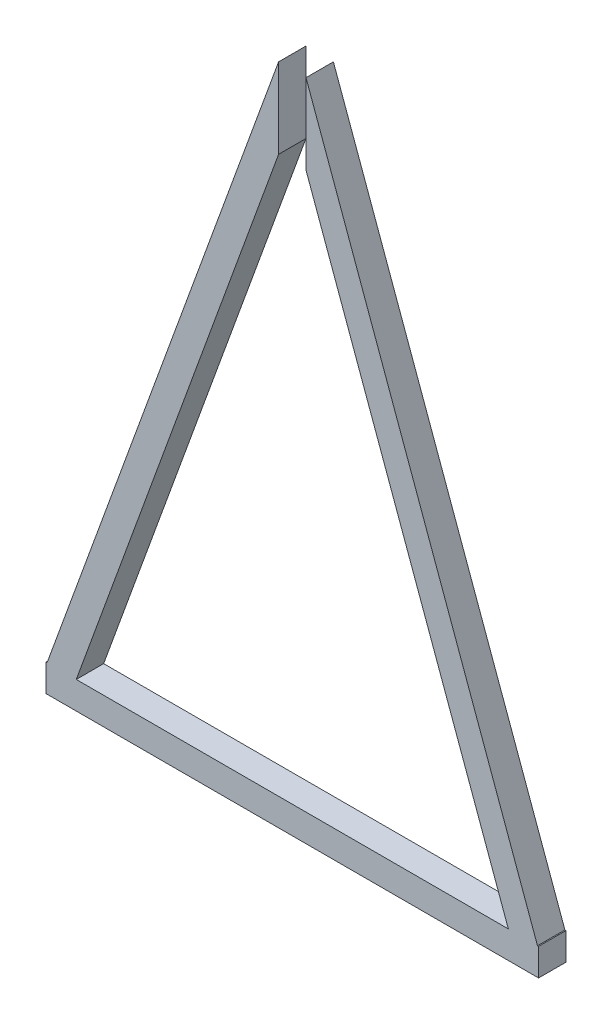
ISO-10303-21;
HEADER;
FILE_DESCRIPTION(('STEP AP214'),'2;1');
FILE_NAME('part.step','',(''),(''),'','','');
FILE_SCHEMA(('AUTOMOTIVE_DESIGN { 1 0 10303 214 1 1 1 1 }'));
ENDSEC;
DATA;
#1=APPLICATION_CONTEXT('core data for automotive mechanical design processes');
#2=APPLICATION_PROTOCOL_DEFINITION('international standard','automotive_design',2000,#1);
#3=PRODUCT_CONTEXT('',#1,'mechanical');
#4=PRODUCT('Part','Part','',(#3));
#5=PRODUCT_RELATED_PRODUCT_CATEGORY('part','',(#4));
#6=PRODUCT_DEFINITION_FORMATION('','',#4);
#7=PRODUCT_DEFINITION_CONTEXT('part definition',#1,'design');
#8=PRODUCT_DEFINITION('design','',#6,#7);
#9=PRODUCT_DEFINITION_SHAPE('','',#8);
#10=(LENGTH_UNIT() NAMED_UNIT(*) SI_UNIT(.MILLI.,.METRE.));
#11=(NAMED_UNIT(*) PLANE_ANGLE_UNIT() SI_UNIT($,.RADIAN.));
#12=(NAMED_UNIT(*) SI_UNIT($,.STERADIAN.) SOLID_ANGLE_UNIT());
#13=UNCERTAINTY_MEASURE_WITH_UNIT(LENGTH_MEASURE(1.E-05),#10,'distance_accuracy_value','');
#14=(GEOMETRIC_REPRESENTATION_CONTEXT(3) GLOBAL_UNCERTAINTY_ASSIGNED_CONTEXT((#13)) GLOBAL_UNIT_ASSIGNED_CONTEXT((#10,
#11,#12)) REPRESENTATION_CONTEXT('',''));
#15=CARTESIAN_POINT('',(0.,0.,0.));
#16=DIRECTION('',(0.,0.,1.));
#17=DIRECTION('',(1.,0.,0.));
#18=AXIS2_PLACEMENT_3D('',#15,#16,#17);
#19=CARTESIAN_POINT('',(0.,76.2,76.2));
#20=DIRECTION('',(0.,-1.,0.));
#21=DIRECTION('',(0.,0.,-1.));
#22=AXIS2_PLACEMENT_3D('',#19,#20,#21);
#23=PLANE('',#22);
#24=DIRECTION('',(-1.,0.,0.));
#25=VECTOR('',#24,1.);
#26=CARTESIAN_POINT('',(0.,76.2,76.2));
#27=LINE('',#26,#25);
#28=CARTESIAN_POINT('',(2.95543030107781,76.2,76.2));
#29=VERTEX_POINT('',#28);
#30=CARTESIAN_POINT('',(0.,76.2,76.2));
#31=VERTEX_POINT('',#30);
#32=EDGE_CURVE('E47',#29,#31,#27,.T.);
#33=ORIENTED_EDGE('',*,*,#32,.F.);
#34=DIRECTION('',(0.,0.,1.));
#35=VECTOR('',#34,1.);
#36=CARTESIAN_POINT('',(2.95543030107781,76.2,-1882.76796634687));
#37=LINE('',#36,#35);
#38=CARTESIAN_POINT('',(2.95543030107781,76.2,0.));
#39=VERTEX_POINT('',#38);
#40=EDGE_CURVE('E134',#39,#29,#37,.T.);
#41=ORIENTED_EDGE('',*,*,#40,.F.);
#42=DIRECTION('',(-1.,0.,0.));
#43=VECTOR('',#42,1.);
#44=CARTESIAN_POINT('',(0.,76.2,0.));
#45=LINE('',#44,#43);
#46=CARTESIAN_POINT('',(0.,76.2,0.));
#47=VERTEX_POINT('',#46);
#48=EDGE_CURVE('E122',#39,#47,#45,.T.);
#49=ORIENTED_EDGE('',*,*,#48,.T.);
#50=DIRECTION('',(0.,0.,-1.));
#51=VECTOR('',#50,1.);
#52=CARTESIAN_POINT('',(0.,76.2,76.2));
#53=LINE('',#52,#51);
#54=EDGE_CURVE('E196',#31,#47,#53,.T.);
#55=ORIENTED_EDGE('',*,*,#54,.F.);
#56=EDGE_LOOP('',(#33,#41,#49,#55));
#57=FACE_BOUND('',#56,.T.);
#58=ADVANCED_FACE('F32',(#57),#23,.F.);
#59=CARTESIAN_POINT('',(1285.95422343626,76.2000000000003,0.));
#60=VERTEX_POINT('',#59);
#61=CARTESIAN_POINT('',(84.0457765637421,76.2,0.));
#62=VERTEX_POINT('',#61);
#63=EDGE_CURVE('E130',#60,#62,#45,.T.);
#64=ORIENTED_EDGE('',*,*,#63,.T.);
#65=DIRECTION('',(0.,0.,1.));
#66=VECTOR('',#65,1.);
#67=CARTESIAN_POINT('',(84.0457765637421,76.2,-1882.76796634687));
#68=LINE('',#67,#66);
#69=CARTESIAN_POINT('',(84.0457765637421,76.2,76.2));
#70=VERTEX_POINT('',#69);
#71=EDGE_CURVE('E55',#62,#70,#68,.T.);
#72=ORIENTED_EDGE('',*,*,#71,.T.);
#73=CARTESIAN_POINT('',(1285.95422343626,76.2,76.2));
#74=VERTEX_POINT('',#73);
#75=EDGE_CURVE('E197',#74,#70,#27,.T.);
#76=ORIENTED_EDGE('',*,*,#75,.F.);
#77=DIRECTION('',(0.,0.,1.));
#78=VECTOR('',#77,1.);
#79=CARTESIAN_POINT('',(1285.95422343626,76.2,-1882.76796634687));
#80=LINE('',#79,#78);
#81=EDGE_CURVE('E175',#60,#74,#80,.T.);
#82=ORIENTED_EDGE('',*,*,#81,.F.);
#83=EDGE_LOOP('',(#64,#72,#76,#82));
#84=FACE_BOUND('',#83,.T.);
#85=ADVANCED_FACE('F226',(#84),#23,.F.);
#86=CARTESIAN_POINT('',(0.,0.,76.2));
#87=DIRECTION('',(1.,0.,0.));
#88=DIRECTION('',(0.,0.,-1.));
#89=AXIS2_PLACEMENT_3D('',#86,#87,#88);
#90=PLANE('',#89);
#91=DIRECTION('',(0.,-1.,0.));
#92=VECTOR('',#91,1.);
#93=CARTESIAN_POINT('',(0.,0.,0.));
#94=LINE('',#93,#92);
#95=CARTESIAN_POINT('',(0.,0.,0.));
#96=VERTEX_POINT('',#95);
#97=EDGE_CURVE('E128',#47,#96,#94,.T.);
#98=ORIENTED_EDGE('',*,*,#97,.T.);
#99=DIRECTION('',(0.,0.,-1.));
#100=VECTOR('',#99,1.);
#101=CARTESIAN_POINT('',(0.,0.,76.2));
#102=LINE('',#101,#100);
#103=CARTESIAN_POINT('',(0.,0.,76.2));
#104=VERTEX_POINT('',#103);
#105=EDGE_CURVE('E11',#104,#96,#102,.T.);
#106=ORIENTED_EDGE('',*,*,#105,.F.);
#107=DIRECTION('',(0.,-1.,0.));
#108=VECTOR('',#107,1.);
#109=CARTESIAN_POINT('',(0.,0.,76.2));
#110=LINE('',#109,#108);
#111=EDGE_CURVE('E186',#31,#104,#110,.T.);
#112=ORIENTED_EDGE('',*,*,#111,.F.);
#113=ORIENTED_EDGE('',*,*,#54,.T.);
#114=EDGE_LOOP('',(#98,#106,#112,#113));
#115=FACE_BOUND('',#114,.T.);
#116=ADVANCED_FACE('F34',(#115),#90,.F.);
#117=CARTESIAN_POINT('',(0.,0.,76.2));
#118=DIRECTION('',(0.,1.,0.));
#119=DIRECTION('',(0.,0.,1.));
#120=AXIS2_PLACEMENT_3D('',#117,#118,#119);
#121=PLANE('',#120);
#122=DIRECTION('',(1.,0.,0.));
#123=VECTOR('',#122,1.);
#124=CARTESIAN_POINT('',(0.,0.,0.));
#125=LINE('',#124,#123);
#126=CARTESIAN_POINT('',(1370.,0.,0.));
#127=VERTEX_POINT('',#126);
#128=EDGE_CURVE('E199',#96,#127,#125,.T.);
#129=ORIENTED_EDGE('',*,*,#128,.T.);
#130=DIRECTION('',(0.,0.,-1.));
#131=VECTOR('',#130,1.);
#132=CARTESIAN_POINT('',(1370.,0.,76.2));
#133=LINE('',#132,#131);
#134=CARTESIAN_POINT('',(1370.,0.,76.2));
#135=VERTEX_POINT('',#134);
#136=EDGE_CURVE('E40',#135,#127,#133,.T.);
#137=ORIENTED_EDGE('',*,*,#136,.F.);
#138=DIRECTION('',(1.,0.,0.));
#139=VECTOR('',#138,1.);
#140=CARTESIAN_POINT('',(0.,0.,76.2));
#141=LINE('',#140,#139);
#142=EDGE_CURVE('E189',#104,#135,#141,.T.);
#143=ORIENTED_EDGE('',*,*,#142,.F.);
#144=ORIENTED_EDGE('',*,*,#105,.T.);
#145=EDGE_LOOP('',(#129,#137,#143,#144));
#146=FACE_BOUND('',#145,.T.);
#147=ADVANCED_FACE('F223',(#146),#121,.F.);
#148=CARTESIAN_POINT('',(1370.,0.,76.2));
#149=DIRECTION('',(-1.,0.,0.));
#150=DIRECTION('',(0.,0.,1.));
#151=AXIS2_PLACEMENT_3D('',#148,#149,#150);
#152=PLANE('',#151);
#153=DIRECTION('',(0.,1.,0.));
#154=VECTOR('',#153,1.);
#155=CARTESIAN_POINT('',(1370.,0.,0.));
#156=LINE('',#155,#154);
#157=CARTESIAN_POINT('',(1370.,76.2,0.));
#158=VERTEX_POINT('',#157);
#159=EDGE_CURVE('E131',#127,#158,#156,.T.);
#160=ORIENTED_EDGE('',*,*,#159,.T.);
#161=DIRECTION('',(0.,0.,-1.));
#162=VECTOR('',#161,1.);
#163=CARTESIAN_POINT('',(1370.,76.2,76.2));
#164=LINE('',#163,#162);
#165=CARTESIAN_POINT('',(1370.,76.2,76.2));
#166=VERTEX_POINT('',#165);
#167=EDGE_CURVE('E204',#166,#158,#164,.T.);
#168=ORIENTED_EDGE('',*,*,#167,.F.);
#169=DIRECTION('',(0.,1.,0.));
#170=VECTOR('',#169,1.);
#171=CARTESIAN_POINT('',(1370.,0.,76.2));
#172=LINE('',#171,#170);
#173=EDGE_CURVE('E191',#135,#166,#172,.T.);
#174=ORIENTED_EDGE('',*,*,#173,.F.);
#175=ORIENTED_EDGE('',*,*,#136,.T.);
#176=EDGE_LOOP('',(#160,#168,#174,#175));
#177=FACE_BOUND('',#176,.T.);
#178=ADVANCED_FACE('F211',(#177),#152,.F.);
#179=CARTESIAN_POINT('',(1367.04456969892,76.2,0.));
#180=VERTEX_POINT('',#179);
#181=EDGE_CURVE('E133',#158,#180,#45,.T.);
#182=ORIENTED_EDGE('',*,*,#181,.T.);
#183=DIRECTION('',(0.,0.,1.));
#184=VECTOR('',#183,1.);
#185=CARTESIAN_POINT('',(1367.04456969892,76.2000000000002,-1882.76796634687));
#186=LINE('',#185,#184);
#187=CARTESIAN_POINT('',(1367.04456969892,76.2,76.2));
#188=VERTEX_POINT('',#187);
#189=EDGE_CURVE('E181',#180,#188,#186,.T.);
#190=ORIENTED_EDGE('',*,*,#189,.T.);
#191=EDGE_CURVE('E193',#166,#188,#27,.T.);
#192=ORIENTED_EDGE('',*,*,#191,.F.);
#193=ORIENTED_EDGE('',*,*,#167,.T.);
#194=EDGE_LOOP('',(#182,#190,#192,#193));
#195=FACE_BOUND('',#194,.T.);
#196=ADVANCED_FACE('F217',(#195),#23,.F.);
#197=CARTESIAN_POINT('',(0.,0.,76.2));
#198=DIRECTION('',(0.,0.,-1.));
#199=DIRECTION('',(-1.,0.,0.));
#200=AXIS2_PLACEMENT_3D('',#197,#198,#199);
#201=PLANE('',#200);
#202=ORIENTED_EDGE('',*,*,#111,.T.);
#203=ORIENTED_EDGE('',*,*,#142,.T.);
#204=ORIENTED_EDGE('',*,*,#173,.T.);
#205=ORIENTED_EDGE('',*,*,#191,.T.);
#206=DIRECTION('',(-0.342020143325663,0.939692620785911,0.));
#207=VECTOR('',#206,1.);
#208=CARTESIAN_POINT('',(723.1,1845.42316462825,76.2));
#209=LINE('',#208,#207);
#210=CARTESIAN_POINT('',(723.1,1845.42316462825,76.2));
#211=VERTEX_POINT('',#210);
#212=EDGE_CURVE('E160',#188,#211,#209,.T.);
#213=ORIENTED_EDGE('',*,*,#212,.T.);
#214=DIRECTION('',(0.,-1.,0.));
#215=VECTOR('',#214,1.);
#216=CARTESIAN_POINT('',(723.1,1845.42316462825,76.2));
#217=LINE('',#216,#215);
#218=CARTESIAN_POINT('',(723.1,1622.62926933581,76.2));
#219=VERTEX_POINT('',#218);
#220=EDGE_CURVE('E165',#211,#219,#217,.T.);
#221=ORIENTED_EDGE('',*,*,#220,.T.);
#222=DIRECTION('',(0.342020143325663,-0.93969262078591,0.));
#223=VECTOR('',#222,1.);
#224=CARTESIAN_POINT('',(723.1,1622.62926933581,76.2));
#225=LINE('',#224,#223);
#226=EDGE_CURVE('E161',#219,#74,#225,.T.);
#227=ORIENTED_EDGE('',*,*,#226,.T.);
#228=ORIENTED_EDGE('',*,*,#75,.T.);
#229=DIRECTION('',(0.342020143325663,0.939692620785911,0.));
#230=VECTOR('',#229,1.);
#231=CARTESIAN_POINT('',(646.9,1622.62926933581,76.2));
#232=LINE('',#231,#230);
#233=CARTESIAN_POINT('',(646.9,1622.62926933581,76.2));
#234=VERTEX_POINT('',#233);
#235=EDGE_CURVE('E142',#70,#234,#232,.T.);
#236=ORIENTED_EDGE('',*,*,#235,.T.);
#237=DIRECTION('',(0.,1.,0.));
#238=VECTOR('',#237,1.);
#239=CARTESIAN_POINT('',(646.9,1845.42316462825,76.2));
#240=LINE('',#239,#238);
#241=CARTESIAN_POINT('',(646.9,1845.42316462825,76.2));
#242=VERTEX_POINT('',#241);
#243=EDGE_CURVE('E149',#234,#242,#240,.T.);
#244=ORIENTED_EDGE('',*,*,#243,.T.);
#245=DIRECTION('',(-0.342020143325663,-0.93969262078591,0.));
#246=VECTOR('',#245,1.);
#247=CARTESIAN_POINT('',(646.9,1845.42316462825,76.2));
#248=LINE('',#247,#246);
#249=EDGE_CURVE('E145',#242,#29,#248,.T.);
#250=ORIENTED_EDGE('',*,*,#249,.T.);
#251=ORIENTED_EDGE('',*,*,#32,.T.);
#252=EDGE_LOOP('',(#202,#203,#204,#205,#213,#221,#227,#228,#236,#244,#250,#251));
#253=FACE_BOUND('',#252,.T.);
#254=ADVANCED_FACE('F220',(#253),#201,.F.);
#255=CARTESIAN_POINT('',(0.,0.,0.));
#256=DIRECTION('',(0.,0.,-1.));
#257=DIRECTION('',(-1.,0.,0.));
#258=AXIS2_PLACEMENT_3D('',#255,#256,#257);
#259=PLANE('',#258);
#260=ORIENTED_EDGE('',*,*,#97,.F.);
#261=ORIENTED_EDGE('',*,*,#48,.F.);
#262=DIRECTION('',(-0.342020143325663,-0.939692620785911,0.));
#263=VECTOR('',#262,1.);
#264=CARTESIAN_POINT('',(646.9,1845.42316462825,0.));
#265=LINE('',#264,#263);
#266=CARTESIAN_POINT('',(646.9,1845.42316462825,0.));
#267=VERTEX_POINT('',#266);
#268=EDGE_CURVE('E125',#267,#39,#265,.T.);
#269=ORIENTED_EDGE('',*,*,#268,.F.);
#270=DIRECTION('',(0.,1.,0.));
#271=VECTOR('',#270,1.);
#272=CARTESIAN_POINT('',(646.9,1845.42316462825,0.));
#273=LINE('',#272,#271);
#274=CARTESIAN_POINT('',(646.9,1622.62926933581,0.));
#275=VERTEX_POINT('',#274);
#276=EDGE_CURVE('E151',#275,#267,#273,.T.);
#277=ORIENTED_EDGE('',*,*,#276,.F.);
#278=DIRECTION('',(0.342020143325663,0.939692620785911,0.));
#279=VECTOR('',#278,1.);
#280=CARTESIAN_POINT('',(646.9,1622.62926933581,0.));
#281=LINE('',#280,#279);
#282=EDGE_CURVE('E154',#62,#275,#281,.T.);
#283=ORIENTED_EDGE('',*,*,#282,.F.);
#284=ORIENTED_EDGE('',*,*,#63,.F.);
#285=DIRECTION('',(0.342020143325663,-0.93969262078591,0.));
#286=VECTOR('',#285,1.);
#287=CARTESIAN_POINT('',(723.1,1622.62926933581,0.));
#288=LINE('',#287,#286);
#289=CARTESIAN_POINT('',(723.1,1622.62926933581,0.));
#290=VERTEX_POINT('',#289);
#291=EDGE_CURVE('E173',#290,#60,#288,.T.);
#292=ORIENTED_EDGE('',*,*,#291,.F.);
#293=DIRECTION('',(0.,-1.,0.));
#294=VECTOR('',#293,1.);
#295=CARTESIAN_POINT('',(723.1,1845.42316462825,0.));
#296=LINE('',#295,#294);
#297=CARTESIAN_POINT('',(723.1,1845.42316462825,0.));
#298=VERTEX_POINT('',#297);
#299=EDGE_CURVE('E177',#298,#290,#296,.T.);
#300=ORIENTED_EDGE('',*,*,#299,.F.);
#301=DIRECTION('',(-0.342020143325663,0.939692620785911,0.));
#302=VECTOR('',#301,1.);
#303=CARTESIAN_POINT('',(723.1,1845.42316462825,0.));
#304=LINE('',#303,#302);
#305=EDGE_CURVE('E164',#180,#298,#304,.T.);
#306=ORIENTED_EDGE('',*,*,#305,.F.);
#307=ORIENTED_EDGE('',*,*,#181,.F.);
#308=ORIENTED_EDGE('',*,*,#159,.F.);
#309=ORIENTED_EDGE('',*,*,#128,.F.);
#310=EDGE_LOOP('',(#260,#261,#269,#277,#283,#284,#292,#300,#306,#307,#308,#309));
#311=FACE_BOUND('',#310,.T.);
#312=ADVANCED_FACE('F123',(#311),#259,.T.);
#313=CARTESIAN_POINT('',(723.1,1845.42316462825,-1882.76796634687));
#314=DIRECTION('',(0.93969262078591,0.342020143325663,0.));
#315=DIRECTION('',(-0.342020143325663,0.939692620785911,0.));
#316=AXIS2_PLACEMENT_3D('',#313,#314,#315);
#317=PLANE('',#316);
#318=ORIENTED_EDGE('',*,*,#189,.F.);
#319=ORIENTED_EDGE('',*,*,#305,.T.);
#320=DIRECTION('',(0.,0.,1.));
#321=VECTOR('',#320,1.);
#322=CARTESIAN_POINT('',(723.1,1845.42316462825,-1882.76796634687));
#323=LINE('',#322,#321);
#324=EDGE_CURVE('E172',#298,#211,#323,.T.);
#325=ORIENTED_EDGE('',*,*,#324,.T.);
#326=ORIENTED_EDGE('',*,*,#212,.F.);
#327=EDGE_LOOP('',(#318,#319,#325,#326));
#328=FACE_BOUND('',#327,.T.);
#329=ADVANCED_FACE('F279',(#328),#317,.T.);
#330=CARTESIAN_POINT('',(723.1,1845.42316462825,-1882.76796634687));
#331=DIRECTION('',(-1.,0.,0.));
#332=DIRECTION('',(0.,0.,1.));
#333=AXIS2_PLACEMENT_3D('',#330,#331,#332);
#334=PLANE('',#333);
#335=ORIENTED_EDGE('',*,*,#324,.F.);
#336=ORIENTED_EDGE('',*,*,#299,.T.);
#337=DIRECTION('',(0.,0.,1.));
#338=VECTOR('',#337,1.);
#339=CARTESIAN_POINT('',(723.1,1622.62926933581,-1882.76796634687));
#340=LINE('',#339,#338);
#341=EDGE_CURVE('E176',#290,#219,#340,.T.);
#342=ORIENTED_EDGE('',*,*,#341,.T.);
#343=ORIENTED_EDGE('',*,*,#220,.F.);
#344=EDGE_LOOP('',(#335,#336,#342,#343));
#345=FACE_BOUND('',#344,.T.);
#346=ADVANCED_FACE('F304',(#345),#334,.T.);
#347=CARTESIAN_POINT('',(723.1,1622.62926933581,-1882.76796634687));
#348=DIRECTION('',(-0.939692620785911,-0.342020143325663,0.));
#349=DIRECTION('',(0.342020143325663,-0.93969262078591,0.));
#350=AXIS2_PLACEMENT_3D('',#347,#348,#349);
#351=PLANE('',#350);
#352=ORIENTED_EDGE('',*,*,#341,.F.);
#353=ORIENTED_EDGE('',*,*,#291,.T.);
#354=ORIENTED_EDGE('',*,*,#81,.T.);
#355=ORIENTED_EDGE('',*,*,#226,.F.);
#356=EDGE_LOOP('',(#352,#353,#354,#355));
#357=FACE_BOUND('',#356,.T.);
#358=ADVANCED_FACE('F314',(#357),#351,.T.);
#359=CARTESIAN_POINT('',(646.9,1845.42316462825,-1882.76796634687));
#360=DIRECTION('',(-0.939692620785911,0.342020143325663,0.));
#361=DIRECTION('',(-0.342020143325663,-0.939692620785911,0.));
#362=AXIS2_PLACEMENT_3D('',#359,#360,#361);
#363=PLANE('',#362);
#364=DIRECTION('',(0.,0.,1.));
#365=VECTOR('',#364,1.);
#366=CARTESIAN_POINT('',(646.9,1845.42316462825,-1882.76796634687));
#367=LINE('',#366,#365);
#368=EDGE_CURVE('E141',#267,#242,#367,.T.);
#369=ORIENTED_EDGE('',*,*,#368,.F.);
#370=ORIENTED_EDGE('',*,*,#268,.T.);
#371=ORIENTED_EDGE('',*,*,#40,.T.);
#372=ORIENTED_EDGE('',*,*,#249,.F.);
#373=EDGE_LOOP('',(#369,#370,#371,#372));
#374=FACE_BOUND('',#373,.T.);
#375=ADVANCED_FACE('F140',(#374),#363,.T.);
#376=CARTESIAN_POINT('',(646.9,1622.62926933581,-1882.76796634687));
#377=DIRECTION('',(0.93969262078591,-0.342020143325663,0.));
#378=DIRECTION('',(0.342020143325663,0.939692620785911,0.));
#379=AXIS2_PLACEMENT_3D('',#376,#377,#378);
#380=PLANE('',#379);
#381=ORIENTED_EDGE('',*,*,#71,.F.);
#382=ORIENTED_EDGE('',*,*,#282,.T.);
#383=DIRECTION('',(0.,0.,1.));
#384=VECTOR('',#383,1.);
#385=CARTESIAN_POINT('',(646.9,1622.62926933581,-1882.76796634687));
#386=LINE('',#385,#384);
#387=EDGE_CURVE('E153',#275,#234,#386,.T.);
#388=ORIENTED_EDGE('',*,*,#387,.T.);
#389=ORIENTED_EDGE('',*,*,#235,.F.);
#390=EDGE_LOOP('',(#381,#382,#388,#389));
#391=FACE_BOUND('',#390,.T.);
#392=ADVANCED_FACE('F333',(#391),#380,.T.);
#393=CARTESIAN_POINT('',(646.9,1845.42316462825,-1882.76796634687));
#394=DIRECTION('',(1.,0.,0.));
#395=DIRECTION('',(0.,0.,-1.));
#396=AXIS2_PLACEMENT_3D('',#393,#394,#395);
#397=PLANE('',#396);
#398=ORIENTED_EDGE('',*,*,#387,.F.);
#399=ORIENTED_EDGE('',*,*,#276,.T.);
#400=ORIENTED_EDGE('',*,*,#368,.T.);
#401=ORIENTED_EDGE('',*,*,#243,.F.);
#402=EDGE_LOOP('',(#398,#399,#400,#401));
#403=FACE_BOUND('',#402,.T.);
#404=ADVANCED_FACE('F342',(#403),#397,.T.);
#405=CLOSED_SHELL('',(#58,#85,#116,#147,#178,#196,#254,#312,#329,#346,#358,#375,#392,#404));
#406=MANIFOLD_SOLID_BREP('B2',#405);
#407=ADVANCED_BREP_SHAPE_REPRESENTATION('',(#18,#406),#14);
#408=SHAPE_DEFINITION_REPRESENTATION(#9,#407);
ENDSEC;
END-ISO-10303-21;
